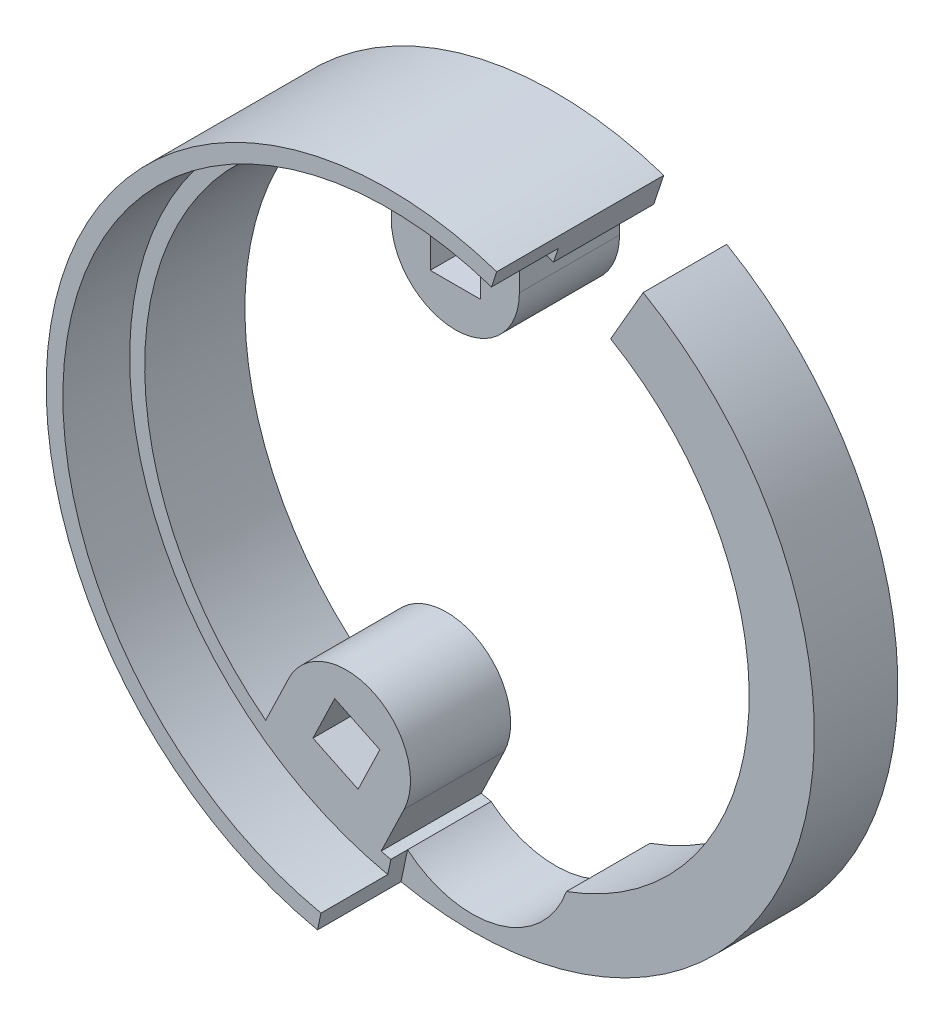
ISO-10303-21;
HEADER;
FILE_DESCRIPTION(('STEP AP214'),'2;1');
FILE_NAME('part.step','',(''),(''),'','','');
FILE_SCHEMA(('AUTOMOTIVE_DESIGN { 1 0 10303 214 1 1 1 1 }'));
ENDSEC;
DATA;
#1=APPLICATION_CONTEXT('core data for automotive mechanical design processes');
#2=APPLICATION_PROTOCOL_DEFINITION('international standard','automotive_design',2000,#1);
#3=PRODUCT_CONTEXT('',#1,'mechanical');
#4=PRODUCT('Part','Part','',(#3));
#5=PRODUCT_RELATED_PRODUCT_CATEGORY('part','',(#4));
#6=PRODUCT_DEFINITION_FORMATION('','',#4);
#7=PRODUCT_DEFINITION_CONTEXT('part definition',#1,'design');
#8=PRODUCT_DEFINITION('design','',#6,#7);
#9=PRODUCT_DEFINITION_SHAPE('','',#8);
#10=(LENGTH_UNIT() NAMED_UNIT(*) SI_UNIT(.MILLI.,.METRE.));
#11=(NAMED_UNIT(*) PLANE_ANGLE_UNIT() SI_UNIT($,.RADIAN.));
#12=(NAMED_UNIT(*) SI_UNIT($,.STERADIAN.) SOLID_ANGLE_UNIT());
#13=UNCERTAINTY_MEASURE_WITH_UNIT(LENGTH_MEASURE(1.E-05),#10,'distance_accuracy_value','');
#14=(GEOMETRIC_REPRESENTATION_CONTEXT(3) GLOBAL_UNCERTAINTY_ASSIGNED_CONTEXT((#13)) GLOBAL_UNIT_ASSIGNED_CONTEXT((#10,
#11,#12)) REPRESENTATION_CONTEXT('',''));
#15=CARTESIAN_POINT('',(0.,0.,0.));
#16=DIRECTION('',(0.,0.,1.));
#17=DIRECTION('',(1.,0.,0.));
#18=AXIS2_PLACEMENT_3D('',#15,#16,#17);
#19=CARTESIAN_POINT('',(0.,0.,6.));
#20=DIRECTION('',(0.,0.,-1.));
#21=DIRECTION('',(-1.,0.,0.));
#22=AXIS2_PLACEMENT_3D('',#19,#20,#21);
#23=CYLINDRICAL_SURFACE('',#22,18.6);
#24=DIRECTION('',(0.,0.,-1.));
#25=VECTOR('',#24,1.);
#26=CARTESIAN_POINT('',(-4.44120798788724,-18.0619952277794,18.0394074165412));
#27=LINE('',#26,#25);
#28=CARTESIAN_POINT('',(-4.44120798788724,-18.0619952277794,6.));
#29=VERTEX_POINT('',#28);
#30=CARTESIAN_POINT('',(-4.44120798788724,-18.0619952277794,0.));
#31=VERTEX_POINT('',#30);
#32=EDGE_CURVE('E296',#29,#31,#27,.T.);
#33=ORIENTED_EDGE('',*,*,#32,.F.);
#34=CARTESIAN_POINT('',(0.,0.,6.));
#35=DIRECTION('',(0.,0.,1.));
#36=DIRECTION('',(1.,0.,0.));
#37=AXIS2_PLACEMENT_3D('',#34,#35,#36);
#38=CIRCLE('',#37,18.6);
#39=CARTESIAN_POINT('',(-3.85753402728042,-18.1955882352941,6.));
#40=VERTEX_POINT('',#39);
#41=EDGE_CURVE('E393',#29,#40,#38,.T.);
#42=ORIENTED_EDGE('',*,*,#41,.T.);
#43=DIRECTION('',(0.,0.,-1.));
#44=VECTOR('',#43,1.);
#45=CARTESIAN_POINT('',(-3.85753402728042,-18.1955882352941,6.));
#46=LINE('',#45,#44);
#47=CARTESIAN_POINT('',(-3.85753402728042,-18.1955882352941,5.));
#48=VERTEX_POINT('',#47);
#49=EDGE_CURVE('E386',#40,#48,#46,.T.);
#50=ORIENTED_EDGE('',*,*,#49,.T.);
#51=CARTESIAN_POINT('',(-3.85753402728042,-18.1955882352941,0.));
#52=VERTEX_POINT('',#51);
#53=EDGE_CURVE('E389',#48,#52,#46,.T.);
#54=ORIENTED_EDGE('',*,*,#53,.T.);
#55=CARTESIAN_POINT('',(0.,0.,0.));
#56=DIRECTION('',(0.,0.,1.));
#57=DIRECTION('',(1.,0.,0.));
#58=AXIS2_PLACEMENT_3D('',#55,#56,#57);
#59=CIRCLE('',#58,18.6);
#60=EDGE_CURVE('E219',#31,#52,#59,.T.);
#61=ORIENTED_EDGE('',*,*,#60,.F.);
#62=EDGE_LOOP('',(#33,#42,#50,#54,#61));
#63=FACE_BOUND('',#62,.T.);
#64=ADVANCED_FACE('F35',(#63),#23,.F.);
#65=DIRECTION('',(0.,0.,-1.));
#66=VECTOR('',#65,1.);
#67=CARTESIAN_POINT('',(-11.3523886168903,-14.7337460508555,18.0394074165412));
#68=LINE('',#67,#66);
#69=CARTESIAN_POINT('',(-11.3523886168903,-14.7337460508555,6.));
#70=VERTEX_POINT('',#69);
#71=CARTESIAN_POINT('',(-11.3523886168903,-14.7337460508555,0.));
#72=VERTEX_POINT('',#71);
#73=EDGE_CURVE('E292',#70,#72,#68,.T.);
#74=ORIENTED_EDGE('',*,*,#73,.T.);
#75=CARTESIAN_POINT('',(-3.83541589238637,18.2002633204146,0.));
#76=VERTEX_POINT('',#75);
#77=EDGE_CURVE('E407',#76,#72,#59,.T.);
#78=ORIENTED_EDGE('',*,*,#77,.F.);
#79=DIRECTION('',(0.,0.,-1.));
#80=VECTOR('',#79,1.);
#81=CARTESIAN_POINT('',(-3.83541589238637,18.2002633204146,18.0394074165412));
#82=LINE('',#81,#80);
#83=CARTESIAN_POINT('',(-3.83541589238637,18.2002633204146,6.));
#84=VERTEX_POINT('',#83);
#85=EDGE_CURVE('E351',#84,#76,#82,.T.);
#86=ORIENTED_EDGE('',*,*,#85,.F.);
#87=EDGE_CURVE('E411',#84,#70,#38,.T.);
#88=ORIENTED_EDGE('',*,*,#87,.T.);
#89=EDGE_LOOP('',(#74,#78,#86,#88));
#90=FACE_BOUND('',#89,.T.);
#91=ADVANCED_FACE('F459',(#90),#23,.F.);
#92=CARTESIAN_POINT('',(0.,0.,6.));
#93=DIRECTION('',(-0.86602540378444,0.499999999999997,0.));
#94=DIRECTION('',(-0.499999999999997,-0.86602540378444,0.));
#95=AXIS2_PLACEMENT_3D('',#92,#93,#94);
#96=PLANE('',#95);
#97=DIRECTION('',(0.,0.,-1.));
#98=VECTOR('',#97,1.);
#99=CARTESIAN_POINT('',(8.29999999999997,14.3760217028217,6.));
#100=LINE('',#99,#98);
#101=CARTESIAN_POINT('',(8.29999999999997,14.3760217028217,5.));
#102=VERTEX_POINT('',#101);
#103=CARTESIAN_POINT('',(8.29999999999997,14.3760217028217,0.));
#104=VERTEX_POINT('',#103);
#105=EDGE_CURVE('E382',#102,#104,#100,.T.);
#106=ORIENTED_EDGE('',*,*,#105,.F.);
#107=DIRECTION('',(-0.499999999999996,-0.866025403784441,0.));
#108=VECTOR('',#107,1.);
#109=CARTESIAN_POINT('',(10.25,17.753520777581,5.));
#110=LINE('',#109,#108);
#111=CARTESIAN_POINT('',(10.25,17.753520777581,5.));
#112=VERTEX_POINT('',#111);
#113=EDGE_CURVE('E369',#112,#102,#110,.T.);
#114=ORIENTED_EDGE('',*,*,#113,.F.);
#115=DIRECTION('',(0.,0.,-1.));
#116=VECTOR('',#115,1.);
#117=CARTESIAN_POINT('',(10.25,17.753520777581,6.));
#118=LINE('',#117,#116);
#119=CARTESIAN_POINT('',(10.25,17.753520777581,0.));
#120=VERTEX_POINT('',#119);
#121=EDGE_CURVE('E380',#112,#120,#118,.T.);
#122=ORIENTED_EDGE('',*,*,#121,.T.);
#123=DIRECTION('',(0.499999999999997,0.86602540378444,0.));
#124=VECTOR('',#123,1.);
#125=CARTESIAN_POINT('',(0.,0.,0.));
#126=LINE('',#125,#124);
#127=EDGE_CURVE('E397',#104,#120,#126,.T.);
#128=ORIENTED_EDGE('',*,*,#127,.F.);
#129=EDGE_LOOP('',(#106,#114,#122,#128));
#130=FACE_BOUND('',#129,.T.);
#131=ADVANCED_FACE('F463',(#130),#96,.T.);
#132=CARTESIAN_POINT('',(0.,0.,6.));
#133=DIRECTION('',(0.,0.,-1.));
#134=DIRECTION('',(-1.,0.,0.));
#135=AXIS2_PLACEMENT_3D('',#132,#133,#134);
#136=CYLINDRICAL_SURFACE('',#135,16.6);
#137=DIRECTION('',(0.,0.,-1.));
#138=VECTOR('',#137,1.);
#139=CARTESIAN_POINT('',(5.65424921360477,-15.6073529411765,6.));
#140=LINE('',#139,#138);
#141=CARTESIAN_POINT('',(5.65424921360477,-15.6073529411765,5.));
#142=VERTEX_POINT('',#141);
#143=CARTESIAN_POINT('',(5.65424921360477,-15.6073529411765,0.));
#144=VERTEX_POINT('',#143);
#145=EDGE_CURVE('E384',#142,#144,#140,.T.);
#146=ORIENTED_EDGE('',*,*,#145,.F.);
#147=CARTESIAN_POINT('',(0.,0.,5.));
#148=DIRECTION('',(0.,0.,-1.));
#149=DIRECTION('',(1.,0.,0.));
#150=AXIS2_PLACEMENT_3D('',#147,#148,#149);
#151=CIRCLE('',#150,16.6);
#152=EDGE_CURVE('E371',#102,#142,#151,.T.);
#153=ORIENTED_EDGE('',*,*,#152,.F.);
#154=ORIENTED_EDGE('',*,*,#105,.T.);
#155=CARTESIAN_POINT('',(0.,0.,0.));
#156=DIRECTION('',(0.,0.,1.));
#157=DIRECTION('',(1.,0.,0.));
#158=AXIS2_PLACEMENT_3D('',#155,#156,#157);
#159=CIRCLE('',#158,16.6);
#160=EDGE_CURVE('E394',#144,#104,#159,.T.);
#161=ORIENTED_EDGE('',*,*,#160,.F.);
#162=EDGE_LOOP('',(#146,#153,#154,#161));
#163=FACE_BOUND('',#162,.T.);
#164=ADVANCED_FACE('F473',(#163),#136,.F.);
#165=CARTESIAN_POINT('',(0.,-13.6,6.));
#166=DIRECTION('',(0.,0.,-1.));
#167=DIRECTION('',(-1.,0.,0.));
#168=AXIS2_PLACEMENT_3D('',#165,#166,#167);
#169=CYLINDRICAL_SURFACE('',#168,6.);
#170=ORIENTED_EDGE('',*,*,#53,.F.);
#171=CARTESIAN_POINT('',(0.,-13.6,5.));
#172=DIRECTION('',(0.,0.,-1.));
#173=DIRECTION('',(1.,0.,0.));
#174=AXIS2_PLACEMENT_3D('',#171,#172,#173);
#175=CIRCLE('',#174,6.);
#176=EDGE_CURVE('E373',#142,#48,#175,.T.);
#177=ORIENTED_EDGE('',*,*,#176,.F.);
#178=ORIENTED_EDGE('',*,*,#145,.T.);
#179=CARTESIAN_POINT('',(0.,-13.6,0.));
#180=DIRECTION('',(0.,0.,1.));
#181=DIRECTION('',(1.,0.,0.));
#182=AXIS2_PLACEMENT_3D('',#179,#180,#181);
#183=CIRCLE('',#182,6.);
#184=EDGE_CURVE('E390',#52,#144,#183,.T.);
#185=ORIENTED_EDGE('',*,*,#184,.F.);
#186=EDGE_LOOP('',(#170,#177,#178,#185));
#187=FACE_BOUND('',#186,.T.);
#188=ADVANCED_FACE('F467',(#187),#169,.F.);
#189=DIRECTION('',(0.,0.,-1.));
#190=VECTOR('',#189,1.);
#191=CARTESIAN_POINT('',(3.83541589239431,18.200263320413,18.0394074165412));
#192=LINE('',#191,#190);
#193=CARTESIAN_POINT('',(3.83541589239431,18.200263320413,6.));
#194=VERTEX_POINT('',#193);
#195=CARTESIAN_POINT('',(3.83541589239431,18.200263320413,0.));
#196=VERTEX_POINT('',#195);
#197=EDGE_CURVE('E347',#194,#196,#192,.T.);
#198=ORIENTED_EDGE('',*,*,#197,.T.);
#199=CARTESIAN_POINT('',(5.88204496096024,17.6454398380217,0.));
#200=VERTEX_POINT('',#199);
#201=EDGE_CURVE('E405',#200,#196,#59,.T.);
#202=ORIENTED_EDGE('',*,*,#201,.F.);
#203=DIRECTION('',(0.,0.,-1.));
#204=VECTOR('',#203,1.);
#205=CARTESIAN_POINT('',(5.88204496096024,17.6454398380217,6.));
#206=LINE('',#205,#204);
#207=CARTESIAN_POINT('',(5.88204496096024,17.6454398380217,6.));
#208=VERTEX_POINT('',#207);
#209=EDGE_CURVE('E11',#208,#200,#206,.T.);
#210=ORIENTED_EDGE('',*,*,#209,.F.);
#211=EDGE_CURVE('E409',#208,#194,#38,.T.);
#212=ORIENTED_EDGE('',*,*,#211,.T.);
#213=EDGE_LOOP('',(#198,#202,#210,#212));
#214=FACE_BOUND('',#213,.T.);
#215=ADVANCED_FACE('F37',(#214),#23,.F.);
#216=CARTESIAN_POINT('',(0.,0.,6.));
#217=DIRECTION('',(-0.948679561183961,0.316238976395712,0.));
#218=DIRECTION('',(-0.316238976395712,-0.948679561183961,0.));
#219=AXIS2_PLACEMENT_3D('',#216,#217,#218);
#220=PLANE('',#219);
#221=DIRECTION('',(0.316238976395712,0.948679561183961,0.));
#222=VECTOR('',#221,1.);
#223=CARTESIAN_POINT('',(0.,0.,0.));
#224=LINE('',#223,#222);
#225=CARTESIAN_POINT('',(6.48289901611209,19.4479310042712,0.));
#226=VERTEX_POINT('',#225);
#227=EDGE_CURVE('E403',#200,#226,#224,.T.);
#228=ORIENTED_EDGE('',*,*,#227,.T.);
#229=DIRECTION('',(0.,0.,-1.));
#230=VECTOR('',#229,1.);
#231=CARTESIAN_POINT('',(6.48289901611209,19.4479310042712,6.));
#232=LINE('',#231,#230);
#233=CARTESIAN_POINT('',(6.48289901611209,19.4479310042712,10.));
#234=VERTEX_POINT('',#233);
#235=EDGE_CURVE('E44',#234,#226,#232,.T.);
#236=ORIENTED_EDGE('',*,*,#235,.F.);
#237=DIRECTION('',(0.316238976395713,0.94867956118396,0.));
#238=VECTOR('',#237,1.);
#239=CARTESIAN_POINT('',(6.16666003971638,18.4992514430872,10.));
#240=LINE('',#239,#238);
#241=CARTESIAN_POINT('',(6.16666003971638,18.4992514430872,10.));
#242=VERTEX_POINT('',#241);
#243=EDGE_CURVE('E234',#242,#234,#240,.T.);
#244=ORIENTED_EDGE('',*,*,#243,.F.);
#245=DIRECTION('',(0.,0.,-1.));
#246=VECTOR('',#245,1.);
#247=CARTESIAN_POINT('',(6.16666003971638,18.4992514430872,10.));
#248=LINE('',#247,#246);
#249=CARTESIAN_POINT('',(6.16666003971638,18.4992514430872,6.));
#250=VERTEX_POINT('',#249);
#251=EDGE_CURVE('E240',#242,#250,#248,.T.);
#252=ORIENTED_EDGE('',*,*,#251,.T.);
#253=DIRECTION('',(0.316238976395712,0.948679561183961,0.));
#254=VECTOR('',#253,1.);
#255=CARTESIAN_POINT('',(0.,0.,6.));
#256=LINE('',#255,#254);
#257=EDGE_CURVE('E247',#208,#250,#256,.T.);
#258=ORIENTED_EDGE('',*,*,#257,.F.);
#259=ORIENTED_EDGE('',*,*,#209,.T.);
#260=EDGE_LOOP('',(#228,#236,#244,#252,#258,#259));
#261=FACE_BOUND('',#260,.T.);
#262=ADVANCED_FACE('F466',(#261),#220,.F.);
#263=CARTESIAN_POINT('',(0.,0.,6.));
#264=DIRECTION('',(0.,0.,-1.));
#265=DIRECTION('',(-1.,0.,0.));
#266=AXIS2_PLACEMENT_3D('',#263,#264,#265);
#267=CYLINDRICAL_SURFACE('',#266,20.5);
#268=CARTESIAN_POINT('',(0.,0.,5.));
#269=DIRECTION('',(0.,0.,1.));
#270=DIRECTION('',(1.,0.,0.));
#271=AXIS2_PLACEMENT_3D('',#268,#269,#270);
#272=CIRCLE('',#271,20.5);
#273=CARTESIAN_POINT('',(-4.25158320211014,-20.0542773561037,5.));
#274=VERTEX_POINT('',#273);
#275=EDGE_CURVE('E215',#274,#112,#272,.T.);
#276=ORIENTED_EDGE('',*,*,#275,.F.);
#277=DIRECTION('',(0.,0.,1.));
#278=VECTOR('',#277,1.);
#279=CARTESIAN_POINT('',(-4.25158320211014,-20.0542773561037,5.));
#280=LINE('',#279,#278);
#281=CARTESIAN_POINT('',(-4.25158320211014,-20.0542773561037,10.));
#282=VERTEX_POINT('',#281);
#283=EDGE_CURVE('E208',#274,#282,#280,.T.);
#284=ORIENTED_EDGE('',*,*,#283,.T.);
#285=CARTESIAN_POINT('',(0.,0.,10.));
#286=DIRECTION('',(0.,0.,1.));
#287=DIRECTION('',(1.,0.,0.));
#288=AXIS2_PLACEMENT_3D('',#285,#286,#287);
#289=CIRCLE('',#288,20.5);
#290=EDGE_CURVE('E213',#234,#282,#289,.T.);
#291=ORIENTED_EDGE('',*,*,#290,.F.);
#292=ORIENTED_EDGE('',*,*,#235,.T.);
#293=CARTESIAN_POINT('',(0.,0.,0.));
#294=DIRECTION('',(0.,0.,1.));
#295=DIRECTION('',(1.,0.,0.));
#296=AXIS2_PLACEMENT_3D('',#293,#294,#295);
#297=CIRCLE('',#296,20.5);
#298=EDGE_CURVE('E400',#226,#120,#297,.T.);
#299=ORIENTED_EDGE('',*,*,#298,.T.);
#300=ORIENTED_EDGE('',*,*,#121,.F.);
#301=EDGE_LOOP('',(#276,#284,#291,#292,#299,#300));
#302=FACE_BOUND('',#301,.T.);
#303=ADVANCED_FACE('F210',(#302),#267,.T.);
#304=CARTESIAN_POINT('',(0.,0.,6.));
#305=DIRECTION('',(0.,0.,1.));
#306=DIRECTION('',(1.,0.,0.));
#307=AXIS2_PLACEMENT_3D('',#304,#305,#306);
#308=PLANE('',#307);
#309=CARTESIAN_POINT('',(0.,0.,6.));
#310=DIRECTION('',(0.,0.,-1.));
#311=DIRECTION('',(1.,0.,0.));
#312=AXIS2_PLACEMENT_3D('',#309,#310,#311);
#313=CIRCLE('',#312,19.5);
#314=CARTESIAN_POINT('',(-4.04418889956818,-19.0760199240987,6.));
#315=VERTEX_POINT('',#314);
#316=EDGE_CURVE('E52',#315,#250,#313,.T.);
#317=ORIENTED_EDGE('',*,*,#316,.F.);
#318=DIRECTION('',(-0.207394302541957,-0.97825743200506,0.));
#319=VECTOR('',#318,1.);
#320=CARTESIAN_POINT('',(-3.85753402728042,-18.1955882352941,6.));
#321=LINE('',#320,#319);
#322=EDGE_CURVE('E367',#40,#315,#321,.T.);
#323=ORIENTED_EDGE('',*,*,#322,.F.);
#324=ORIENTED_EDGE('',*,*,#41,.F.);
#325=DIRECTION('',(-0.433883739117553,-0.900968867902422,0.));
#326=VECTOR('',#325,1.);
#327=CARTESIAN_POINT('',(3.4555903144983,-1.66412458845948,6.));
#328=LINE('',#327,#326);
#329=CARTESIAN_POINT('',(-3.06532979610734,-15.2049547234712,6.));
#330=VERTEX_POINT('',#329);
#331=EDGE_CURVE('E243',#330,#29,#328,.T.);
#332=ORIENTED_EDGE('',*,*,#331,.F.);
#333=CARTESIAN_POINT('',(-6.52092011060922,-13.54083013501,6.));
#334=DIRECTION('',(0.,0.,1.));
#335=DIRECTION('',(1.,0.,0.));
#336=AXIS2_PLACEMENT_3D('',#333,#334,#335);
#337=CIRCLE('',#336,3.83541589239033);
#338=CARTESIAN_POINT('',(-9.97651042511108,-11.8767055465487,6.));
#339=VERTEX_POINT('',#338);
#340=EDGE_CURVE('E295',#339,#330,#337,.F.);
#341=ORIENTED_EDGE('',*,*,#340,.F.);
#342=DIRECTION('',(0.433883739117553,0.900968867902422,0.));
#343=VECTOR('',#342,1.);
#344=CARTESIAN_POINT('',(-3.45559031450545,1.66412458846292,6.));
#345=LINE('',#344,#343);
#346=EDGE_CURVE('E254',#70,#339,#345,.T.);
#347=ORIENTED_EDGE('',*,*,#346,.F.);
#348=ORIENTED_EDGE('',*,*,#87,.F.);
#349=DIRECTION('',(0.,1.,0.));
#350=VECTOR('',#349,1.);
#351=CARTESIAN_POINT('',(-3.83541589238637,0.,6.));
#352=LINE('',#351,#350);
#353=CARTESIAN_POINT('',(-3.83541589238637,15.0291875972769,6.));
#354=VERTEX_POINT('',#353);
#355=EDGE_CURVE('E311',#354,#84,#352,.T.);
#356=ORIENTED_EDGE('',*,*,#355,.F.);
#357=CARTESIAN_POINT('',(3.97034835564192E-12,15.0291875972769,6.));
#358=DIRECTION('',(0.,0.,1.));
#359=DIRECTION('',(1.,0.,0.));
#360=AXIS2_PLACEMENT_3D('',#357,#358,#359);
#361=CIRCLE('',#360,3.83541589239034);
#362=CARTESIAN_POINT('',(3.83541589239431,15.0291875972769,6.));
#363=VERTEX_POINT('',#362);
#364=EDGE_CURVE('E350',#363,#354,#361,.F.);
#365=ORIENTED_EDGE('',*,*,#364,.F.);
#366=DIRECTION('',(0.,-1.,0.));
#367=VECTOR('',#366,1.);
#368=CARTESIAN_POINT('',(3.83541589239431,0.,6.));
#369=LINE('',#368,#367);
#370=EDGE_CURVE('E313',#194,#363,#369,.T.);
#371=ORIENTED_EDGE('',*,*,#370,.F.);
#372=ORIENTED_EDGE('',*,*,#211,.F.);
#373=ORIENTED_EDGE('',*,*,#257,.T.);
#374=EDGE_LOOP('',(#317,#323,#324,#332,#341,#347,#348,#356,#365,#371,#372,#373));
#375=FACE_BOUND('',#374,.T.);
#376=DIRECTION('',(1.,0.,0.));
#377=VECTOR('',#376,1.);
#378=CARTESIAN_POINT('',(0.,13.5291875972755,6.));
#379=LINE('',#378,#377);
#380=CARTESIAN_POINT('',(-1.49999999999748,13.5291875972755,6.));
#381=VERTEX_POINT('',#380);
#382=CARTESIAN_POINT('',(1.50000000000539,13.5291875972755,6.));
#383=VERTEX_POINT('',#382);
#384=EDGE_CURVE('E323',#381,#383,#379,.T.);
#385=ORIENTED_EDGE('',*,*,#384,.F.);
#386=DIRECTION('',(0.,1.,0.));
#387=VECTOR('',#386,1.);
#388=CARTESIAN_POINT('',(-1.49999999999748,0.,6.));
#389=LINE('',#388,#387);
#390=CARTESIAN_POINT('',(-1.49999999999748,16.5291875972783,6.));
#391=VERTEX_POINT('',#390);
#392=EDGE_CURVE('E321',#381,#391,#389,.T.);
#393=ORIENTED_EDGE('',*,*,#392,.T.);
#394=DIRECTION('',(1.,0.,0.));
#395=VECTOR('',#394,1.);
#396=CARTESIAN_POINT('',(0.,16.5291875972783,6.));
#397=LINE('',#396,#395);
#398=CARTESIAN_POINT('',(1.50000000000539,16.5291875972783,6.));
#399=VERTEX_POINT('',#398);
#400=EDGE_CURVE('E319',#391,#399,#397,.T.);
#401=ORIENTED_EDGE('',*,*,#400,.T.);
#402=DIRECTION('',(0.,1.,0.));
#403=VECTOR('',#402,1.);
#404=CARTESIAN_POINT('',(1.50000000000539,0.,6.));
#405=LINE('',#404,#403);
#406=EDGE_CURVE('E316',#383,#399,#405,.T.);
#407=ORIENTED_EDGE('',*,*,#406,.F.);
#408=EDGE_LOOP('',(#385,#393,#401,#407));
#409=FACE_BOUND('',#408,.T.);
#410=DIRECTION('',(-0.900968867902422,0.433883739117552,0.));
#411=VECTOR('',#410,1.);
#412=CARTESIAN_POINT('',(-5.87009450192869,-12.1893768331568,6.));
#413=LINE('',#412,#411);
#414=CARTESIAN_POINT('',(-4.51864120007733,-12.840202441832,6.));
#415=VERTEX_POINT('',#414);
#416=CARTESIAN_POINT('',(-7.22154780378718,-11.5385512244781,6.));
#417=VERTEX_POINT('',#416);
#418=EDGE_CURVE('E270',#415,#417,#413,.T.);
#419=ORIENTED_EDGE('',*,*,#418,.F.);
#420=DIRECTION('',(-0.433883739117553,-0.900968867902422,0.));
#421=VECTOR('',#420,1.);
#422=CARTESIAN_POINT('',(1.35145330185137,-0.650825608675239,6.));
#423=LINE('',#422,#421);
#424=CARTESIAN_POINT('',(-5.82029241743123,-15.5431090455418,6.));
#425=VERTEX_POINT('',#424);
#426=EDGE_CURVE('E268',#415,#425,#423,.T.);
#427=ORIENTED_EDGE('',*,*,#426,.T.);
#428=DIRECTION('',(-0.900968867902422,0.433883739117553,0.));
#429=VECTOR('',#428,1.);
#430=CARTESIAN_POINT('',(-7.17174571928259,-14.8922834368666,6.));
#431=LINE('',#430,#429);
#432=CARTESIAN_POINT('',(-8.52319902114108,-14.2414578281879,6.));
#433=VERTEX_POINT('',#432);
#434=EDGE_CURVE('E264',#425,#433,#431,.T.);
#435=ORIENTED_EDGE('',*,*,#434,.T.);
#436=DIRECTION('',(-0.433883739117553,-0.900968867902422,0.));
#437=VECTOR('',#436,1.);
#438=CARTESIAN_POINT('',(-1.35145330185848,0.650825608678665,6.));
#439=LINE('',#438,#437);
#440=EDGE_CURVE('E259',#417,#433,#439,.T.);
#441=ORIENTED_EDGE('',*,*,#440,.F.);
#442=EDGE_LOOP('',(#419,#427,#435,#441));
#443=FACE_BOUND('',#442,.T.);
#444=ADVANCED_FACE('F421',(#375,#409,#443),#308,.T.);
#445=CARTESIAN_POINT('',(0.,0.,0.));
#446=DIRECTION('',(0.,0.,1.));
#447=DIRECTION('',(1.,0.,0.));
#448=AXIS2_PLACEMENT_3D('',#445,#446,#447);
#449=PLANE('',#448);
#450=ORIENTED_EDGE('',*,*,#201,.T.);
#451=DIRECTION('',(0.,-1.,0.));
#452=VECTOR('',#451,1.);
#453=CARTESIAN_POINT('',(3.83541589239431,0.,0.));
#454=LINE('',#453,#452);
#455=CARTESIAN_POINT('',(3.83541589239431,15.0291875972769,0.));
#456=VERTEX_POINT('',#455);
#457=EDGE_CURVE('E338',#196,#456,#454,.T.);
#458=ORIENTED_EDGE('',*,*,#457,.T.);
#459=CARTESIAN_POINT('',(3.97034835564192E-12,15.0291875972769,0.));
#460=DIRECTION('',(0.,0.,-1.));
#461=DIRECTION('',(-1.,0.,0.));
#462=AXIS2_PLACEMENT_3D('',#459,#460,#461);
#463=CIRCLE('',#462,3.83541589239034);
#464=CARTESIAN_POINT('',(-3.83541589238637,15.0291875972769,0.));
#465=VERTEX_POINT('',#464);
#466=EDGE_CURVE('E341',#456,#465,#463,.T.);
#467=ORIENTED_EDGE('',*,*,#466,.T.);
#468=DIRECTION('',(0.,1.,0.));
#469=VECTOR('',#468,1.);
#470=CARTESIAN_POINT('',(-3.83541589238637,0.,0.));
#471=LINE('',#470,#469);
#472=EDGE_CURVE('E344',#465,#76,#471,.T.);
#473=ORIENTED_EDGE('',*,*,#472,.T.);
#474=ORIENTED_EDGE('',*,*,#77,.T.);
#475=DIRECTION('',(0.433883739117553,0.900968867902422,0.));
#476=VECTOR('',#475,1.);
#477=CARTESIAN_POINT('',(-3.45559031450545,1.66412458846292,0.));
#478=LINE('',#477,#476);
#479=CARTESIAN_POINT('',(-9.97651042511108,-11.8767055465487,0.));
#480=VERTEX_POINT('',#479);
#481=EDGE_CURVE('E285',#72,#480,#478,.T.);
#482=ORIENTED_EDGE('',*,*,#481,.T.);
#483=CARTESIAN_POINT('',(-6.52092011060922,-13.54083013501,0.));
#484=DIRECTION('',(0.,0.,-1.));
#485=DIRECTION('',(-1.,0.,0.));
#486=AXIS2_PLACEMENT_3D('',#483,#484,#485);
#487=CIRCLE('',#486,3.83541589239033);
#488=CARTESIAN_POINT('',(-3.06532979610734,-15.2049547234712,0.));
#489=VERTEX_POINT('',#488);
#490=EDGE_CURVE('E288',#480,#489,#487,.T.);
#491=ORIENTED_EDGE('',*,*,#490,.T.);
#492=DIRECTION('',(-0.433883739117553,-0.900968867902422,0.));
#493=VECTOR('',#492,1.);
#494=CARTESIAN_POINT('',(3.4555903144983,-1.66412458845948,0.));
#495=LINE('',#494,#493);
#496=EDGE_CURVE('E60',#489,#31,#495,.T.);
#497=ORIENTED_EDGE('',*,*,#496,.T.);
#498=ORIENTED_EDGE('',*,*,#60,.T.);
#499=ORIENTED_EDGE('',*,*,#184,.T.);
#500=ORIENTED_EDGE('',*,*,#160,.T.);
#501=ORIENTED_EDGE('',*,*,#127,.T.);
#502=ORIENTED_EDGE('',*,*,#298,.F.);
#503=ORIENTED_EDGE('',*,*,#227,.F.);
#504=EDGE_LOOP('',(#450,#458,#467,#473,#474,#482,#491,#497,#498,#499,#500,#501,#502,#503));
#505=FACE_BOUND('',#504,.T.);
#506=DIRECTION('',(1.,0.,0.));
#507=VECTOR('',#506,1.);
#508=CARTESIAN_POINT('',(0.,13.5291875972755,0.));
#509=LINE('',#508,#507);
#510=CARTESIAN_POINT('',(-1.49999999999748,13.5291875972755,0.));
#511=VERTEX_POINT('',#510);
#512=CARTESIAN_POINT('',(1.50000000000539,13.5291875972755,0.));
#513=VERTEX_POINT('',#512);
#514=EDGE_CURVE('E326',#511,#513,#509,.T.);
#515=ORIENTED_EDGE('',*,*,#514,.T.);
#516=DIRECTION('',(0.,1.,0.));
#517=VECTOR('',#516,1.);
#518=CARTESIAN_POINT('',(1.50000000000539,0.,0.));
#519=LINE('',#518,#517);
#520=CARTESIAN_POINT('',(1.50000000000539,16.5291875972783,0.));
#521=VERTEX_POINT('',#520);
#522=EDGE_CURVE('E329',#513,#521,#519,.T.);
#523=ORIENTED_EDGE('',*,*,#522,.T.);
#524=DIRECTION('',(1.,0.,0.));
#525=VECTOR('',#524,1.);
#526=CARTESIAN_POINT('',(0.,16.5291875972783,0.));
#527=LINE('',#526,#525);
#528=CARTESIAN_POINT('',(-1.49999999999748,16.5291875972783,0.));
#529=VERTEX_POINT('',#528);
#530=EDGE_CURVE('E332',#529,#521,#527,.T.);
#531=ORIENTED_EDGE('',*,*,#530,.F.);
#532=DIRECTION('',(0.,1.,0.));
#533=VECTOR('',#532,1.);
#534=CARTESIAN_POINT('',(-1.49999999999748,0.,0.));
#535=LINE('',#534,#533);
#536=EDGE_CURVE('E335',#511,#529,#535,.T.);
#537=ORIENTED_EDGE('',*,*,#536,.F.);
#538=EDGE_LOOP('',(#515,#523,#531,#537));
#539=FACE_BOUND('',#538,.T.);
#540=DIRECTION('',(-0.900968867902422,0.433883739117552,0.));
#541=VECTOR('',#540,1.);
#542=CARTESIAN_POINT('',(-5.87009450192869,-12.1893768331568,0.));
#543=LINE('',#542,#541);
#544=CARTESIAN_POINT('',(-4.51864120007733,-12.840202441832,0.));
#545=VERTEX_POINT('',#544);
#546=CARTESIAN_POINT('',(-7.22154780378718,-11.5385512244781,0.));
#547=VERTEX_POINT('',#546);
#548=EDGE_CURVE('E273',#545,#547,#543,.T.);
#549=ORIENTED_EDGE('',*,*,#548,.T.);
#550=DIRECTION('',(-0.433883739117553,-0.900968867902422,0.));
#551=VECTOR('',#550,1.);
#552=CARTESIAN_POINT('',(-1.35145330185848,0.650825608678665,0.));
#553=LINE('',#552,#551);
#554=CARTESIAN_POINT('',(-8.52319902114108,-14.2414578281879,0.));
#555=VERTEX_POINT('',#554);
#556=EDGE_CURVE('E276',#547,#555,#553,.T.);
#557=ORIENTED_EDGE('',*,*,#556,.T.);
#558=DIRECTION('',(-0.900968867902422,0.433883739117553,0.));
#559=VECTOR('',#558,1.);
#560=CARTESIAN_POINT('',(-7.17174571928259,-14.8922834368666,0.));
#561=LINE('',#560,#559);
#562=CARTESIAN_POINT('',(-5.82029241743123,-15.5431090455418,0.));
#563=VERTEX_POINT('',#562);
#564=EDGE_CURVE('E279',#563,#555,#561,.T.);
#565=ORIENTED_EDGE('',*,*,#564,.F.);
#566=DIRECTION('',(-0.433883739117553,-0.900968867902422,0.));
#567=VECTOR('',#566,1.);
#568=CARTESIAN_POINT('',(1.35145330185137,-0.650825608675239,0.));
#569=LINE('',#568,#567);
#570=EDGE_CURVE('E282',#545,#563,#569,.T.);
#571=ORIENTED_EDGE('',*,*,#570,.F.);
#572=EDGE_LOOP('',(#549,#557,#565,#571));
#573=FACE_BOUND('',#572,.T.);
#574=ADVANCED_FACE('F424',(#505,#539,#573),#449,.F.);
#575=CARTESIAN_POINT('',(-3.85753402728042,-18.1955882352941,5.));
#576=DIRECTION('',(-0.97825743200506,0.207394302541957,0.));
#577=DIRECTION('',(-0.207394302541957,-0.97825743200506,0.));
#578=AXIS2_PLACEMENT_3D('',#575,#576,#577);
#579=PLANE('',#578);
#580=ORIENTED_EDGE('',*,*,#322,.T.);
#581=DIRECTION('',(0.,0.,-1.));
#582=VECTOR('',#581,1.);
#583=CARTESIAN_POINT('',(-4.04418889956818,-19.0760199240987,10.));
#584=LINE('',#583,#582);
#585=CARTESIAN_POINT('',(-4.04418889956818,-19.0760199240987,10.));
#586=VERTEX_POINT('',#585);
#587=EDGE_CURVE('E226',#586,#315,#584,.T.);
#588=ORIENTED_EDGE('',*,*,#587,.F.);
#589=DIRECTION('',(0.207394302541957,0.978257432005061,0.));
#590=VECTOR('',#589,1.);
#591=CARTESIAN_POINT('',(-4.04418889956818,-19.0760199240987,10.));
#592=LINE('',#591,#590);
#593=EDGE_CURVE('E223',#282,#586,#592,.T.);
#594=ORIENTED_EDGE('',*,*,#593,.F.);
#595=ORIENTED_EDGE('',*,*,#283,.F.);
#596=DIRECTION('',(-0.207394302541957,-0.97825743200506,0.));
#597=VECTOR('',#596,1.);
#598=CARTESIAN_POINT('',(-3.85753402728042,-18.1955882352941,5.));
#599=LINE('',#598,#597);
#600=EDGE_CURVE('E220',#48,#274,#599,.T.);
#601=ORIENTED_EDGE('',*,*,#600,.F.);
#602=ORIENTED_EDGE('',*,*,#49,.F.);
#603=EDGE_LOOP('',(#580,#588,#594,#595,#601,#602));
#604=FACE_BOUND('',#603,.T.);
#605=ADVANCED_FACE('F224',(#604),#579,.F.);
#606=CARTESIAN_POINT('',(0.,0.,5.));
#607=DIRECTION('',(0.,0.,1.));
#608=DIRECTION('',(1.,0.,0.));
#609=AXIS2_PLACEMENT_3D('',#606,#607,#608);
#610=PLANE('',#609);
#611=ORIENTED_EDGE('',*,*,#275,.T.);
#612=ORIENTED_EDGE('',*,*,#113,.T.);
#613=ORIENTED_EDGE('',*,*,#152,.T.);
#614=ORIENTED_EDGE('',*,*,#176,.T.);
#615=ORIENTED_EDGE('',*,*,#600,.T.);
#616=EDGE_LOOP('',(#611,#612,#613,#614,#615));
#617=FACE_BOUND('',#616,.T.);
#618=ADVANCED_FACE('F454',(#617),#610,.T.);
#619=CARTESIAN_POINT('',(1.50000000000539,0.,18.0394074165412));
#620=DIRECTION('',(-1.,0.,0.));
#621=DIRECTION('',(0.,-1.,0.));
#622=AXIS2_PLACEMENT_3D('',#619,#620,#621);
#623=PLANE('',#622);
#624=DIRECTION('',(0.,0.,-1.));
#625=VECTOR('',#624,1.);
#626=CARTESIAN_POINT('',(1.50000000000539,13.5291875972755,18.0394074165412));
#627=LINE('',#626,#625);
#628=EDGE_CURVE('E346',#383,#513,#627,.T.);
#629=ORIENTED_EDGE('',*,*,#628,.F.);
#630=ORIENTED_EDGE('',*,*,#406,.T.);
#631=DIRECTION('',(0.,0.,-1.));
#632=VECTOR('',#631,1.);
#633=CARTESIAN_POINT('',(1.50000000000539,16.5291875972783,18.0394074165412));
#634=LINE('',#633,#632);
#635=EDGE_CURVE('E362',#399,#521,#634,.T.);
#636=ORIENTED_EDGE('',*,*,#635,.T.);
#637=ORIENTED_EDGE('',*,*,#522,.F.);
#638=EDGE_LOOP('',(#629,#630,#636,#637));
#639=FACE_BOUND('',#638,.T.);
#640=ADVANCED_FACE('F541',(#639),#623,.T.);
#641=CARTESIAN_POINT('',(0.,16.5291875972783,18.0394074165412));
#642=DIRECTION('',(0.,1.,0.));
#643=DIRECTION('',(0.,0.,1.));
#644=AXIS2_PLACEMENT_3D('',#641,#642,#643);
#645=PLANE('',#644);
#646=ORIENTED_EDGE('',*,*,#400,.F.);
#647=DIRECTION('',(0.,0.,-1.));
#648=VECTOR('',#647,1.);
#649=CARTESIAN_POINT('',(-1.49999999999748,16.5291875972783,18.0394074165412));
#650=LINE('',#649,#648);
#651=EDGE_CURVE('E360',#391,#529,#650,.T.);
#652=ORIENTED_EDGE('',*,*,#651,.T.);
#653=ORIENTED_EDGE('',*,*,#530,.T.);
#654=ORIENTED_EDGE('',*,*,#635,.F.);
#655=EDGE_LOOP('',(#646,#652,#653,#654));
#656=FACE_BOUND('',#655,.T.);
#657=ADVANCED_FACE('F537',(#656),#645,.F.);
#658=CARTESIAN_POINT('',(-1.49999999999748,0.,18.0394074165412));
#659=DIRECTION('',(-1.,0.,0.));
#660=DIRECTION('',(0.,-1.,0.));
#661=AXIS2_PLACEMENT_3D('',#658,#659,#660);
#662=PLANE('',#661);
#663=ORIENTED_EDGE('',*,*,#392,.F.);
#664=DIRECTION('',(0.,0.,-1.));
#665=VECTOR('',#664,1.);
#666=CARTESIAN_POINT('',(-1.49999999999748,13.5291875972755,18.0394074165412));
#667=LINE('',#666,#665);
#668=EDGE_CURVE('E358',#381,#511,#667,.T.);
#669=ORIENTED_EDGE('',*,*,#668,.T.);
#670=ORIENTED_EDGE('',*,*,#536,.T.);
#671=ORIENTED_EDGE('',*,*,#651,.F.);
#672=EDGE_LOOP('',(#663,#669,#670,#671));
#673=FACE_BOUND('',#672,.T.);
#674=ADVANCED_FACE('F534',(#673),#662,.F.);
#675=CARTESIAN_POINT('',(0.,13.5291875972755,18.0394074165412));
#676=DIRECTION('',(0.,1.,0.));
#677=DIRECTION('',(0.,0.,1.));
#678=AXIS2_PLACEMENT_3D('',#675,#676,#677);
#679=PLANE('',#678);
#680=ORIENTED_EDGE('',*,*,#668,.F.);
#681=ORIENTED_EDGE('',*,*,#384,.T.);
#682=ORIENTED_EDGE('',*,*,#628,.T.);
#683=ORIENTED_EDGE('',*,*,#514,.F.);
#684=EDGE_LOOP('',(#680,#681,#682,#683));
#685=FACE_BOUND('',#684,.T.);
#686=ADVANCED_FACE('F530',(#685),#679,.T.);
#687=CARTESIAN_POINT('',(3.97034835564192E-12,15.0291875972769,18.0394074165412));
#688=DIRECTION('',(0.,0.,-1.));
#689=DIRECTION('',(-1.,0.,0.));
#690=AXIS2_PLACEMENT_3D('',#687,#688,#689);
#691=CYLINDRICAL_SURFACE('',#690,3.83541589239034);
#692=DIRECTION('',(0.,0.,-1.));
#693=VECTOR('',#692,1.);
#694=CARTESIAN_POINT('',(3.83541589239431,15.0291875972769,18.0394074165412));
#695=LINE('',#694,#693);
#696=EDGE_CURVE('E356',#363,#456,#695,.T.);
#697=ORIENTED_EDGE('',*,*,#696,.F.);
#698=ORIENTED_EDGE('',*,*,#364,.T.);
#699=DIRECTION('',(0.,0.,-1.));
#700=VECTOR('',#699,1.);
#701=CARTESIAN_POINT('',(-3.83541589238637,15.0291875972769,18.0394074165412));
#702=LINE('',#701,#700);
#703=EDGE_CURVE('E354',#354,#465,#702,.T.);
#704=ORIENTED_EDGE('',*,*,#703,.T.);
#705=ORIENTED_EDGE('',*,*,#466,.F.);
#706=EDGE_LOOP('',(#697,#698,#704,#705));
#707=FACE_BOUND('',#706,.T.);
#708=ADVANCED_FACE('F526',(#707),#691,.T.);
#709=CARTESIAN_POINT('',(-3.83541589238637,0.,18.0394074165412));
#710=DIRECTION('',(-1.,0.,0.));
#711=DIRECTION('',(0.,0.,1.));
#712=AXIS2_PLACEMENT_3D('',#709,#710,#711);
#713=PLANE('',#712);
#714=ORIENTED_EDGE('',*,*,#703,.F.);
#715=ORIENTED_EDGE('',*,*,#355,.T.);
#716=ORIENTED_EDGE('',*,*,#85,.T.);
#717=ORIENTED_EDGE('',*,*,#472,.F.);
#718=EDGE_LOOP('',(#714,#715,#716,#717));
#719=FACE_BOUND('',#718,.T.);
#720=ADVANCED_FACE('F523',(#719),#713,.T.);
#721=CARTESIAN_POINT('',(3.83541589239431,0.,18.0394074165412));
#722=DIRECTION('',(1.,0.,0.));
#723=DIRECTION('',(0.,0.,-1.));
#724=AXIS2_PLACEMENT_3D('',#721,#722,#723);
#725=PLANE('',#724);
#726=ORIENTED_EDGE('',*,*,#197,.F.);
#727=ORIENTED_EDGE('',*,*,#370,.T.);
#728=ORIENTED_EDGE('',*,*,#696,.T.);
#729=ORIENTED_EDGE('',*,*,#457,.F.);
#730=EDGE_LOOP('',(#726,#727,#728,#729));
#731=FACE_BOUND('',#730,.T.);
#732=ADVANCED_FACE('F520',(#731),#725,.T.);
#733=CARTESIAN_POINT('',(-1.35145330185848,0.650825608678665,18.0394074165412));
#734=DIRECTION('',(0.900968867902422,-0.433883739117553,0.));
#735=DIRECTION('',(0.433883739117553,0.900968867902422,0.));
#736=AXIS2_PLACEMENT_3D('',#733,#734,#735);
#737=PLANE('',#736);
#738=DIRECTION('',(0.,0.,-1.));
#739=VECTOR('',#738,1.);
#740=CARTESIAN_POINT('',(-7.22154780378718,-11.5385512244781,18.0394074165412));
#741=LINE('',#740,#739);
#742=EDGE_CURVE('E291',#417,#547,#741,.T.);
#743=ORIENTED_EDGE('',*,*,#742,.F.);
#744=ORIENTED_EDGE('',*,*,#440,.T.);
#745=DIRECTION('',(0.,0.,-1.));
#746=VECTOR('',#745,1.);
#747=CARTESIAN_POINT('',(-8.52319902114108,-14.2414578281879,18.0394074165412));
#748=LINE('',#747,#746);
#749=EDGE_CURVE('E306',#433,#555,#748,.T.);
#750=ORIENTED_EDGE('',*,*,#749,.T.);
#751=ORIENTED_EDGE('',*,*,#556,.F.);
#752=EDGE_LOOP('',(#743,#744,#750,#751));
#753=FACE_BOUND('',#752,.T.);
#754=ADVANCED_FACE('F445',(#753),#737,.T.);
#755=CARTESIAN_POINT('',(-7.17174571928259,-14.8922834368666,18.0394074165412));
#756=DIRECTION('',(-0.433883739117553,-0.900968867902422,0.));
#757=DIRECTION('',(0.900968867902422,-0.433883739117553,0.));
#758=AXIS2_PLACEMENT_3D('',#755,#756,#757);
#759=PLANE('',#758);
#760=ORIENTED_EDGE('',*,*,#434,.F.);
#761=DIRECTION('',(0.,0.,-1.));
#762=VECTOR('',#761,1.);
#763=CARTESIAN_POINT('',(-5.82029241743123,-15.5431090455418,18.0394074165412));
#764=LINE('',#763,#762);
#765=EDGE_CURVE('E304',#425,#563,#764,.T.);
#766=ORIENTED_EDGE('',*,*,#765,.T.);
#767=ORIENTED_EDGE('',*,*,#564,.T.);
#768=ORIENTED_EDGE('',*,*,#749,.F.);
#769=EDGE_LOOP('',(#760,#766,#767,#768));
#770=FACE_BOUND('',#769,.T.);
#771=ADVANCED_FACE('F442',(#770),#759,.F.);
#772=CARTESIAN_POINT('',(1.35145330185137,-0.650825608675239,18.0394074165412));
#773=DIRECTION('',(0.900968867902422,-0.433883739117553,0.));
#774=DIRECTION('',(0.433883739117553,0.900968867902422,0.));
#775=AXIS2_PLACEMENT_3D('',#772,#773,#774);
#776=PLANE('',#775);
#777=ORIENTED_EDGE('',*,*,#426,.F.);
#778=DIRECTION('',(0.,0.,-1.));
#779=VECTOR('',#778,1.);
#780=CARTESIAN_POINT('',(-4.51864120007733,-12.840202441832,18.0394074165412));
#781=LINE('',#780,#779);
#782=EDGE_CURVE('E302',#415,#545,#781,.T.);
#783=ORIENTED_EDGE('',*,*,#782,.T.);
#784=ORIENTED_EDGE('',*,*,#570,.T.);
#785=ORIENTED_EDGE('',*,*,#765,.F.);
#786=EDGE_LOOP('',(#777,#783,#784,#785));
#787=FACE_BOUND('',#786,.T.);
#788=ADVANCED_FACE('F437',(#787),#776,.F.);
#789=CARTESIAN_POINT('',(-5.87009450192869,-12.1893768331568,18.0394074165412));
#790=DIRECTION('',(-0.433883739117552,-0.900968867902422,0.));
#791=DIRECTION('',(0.900968867902422,-0.433883739117552,0.));
#792=AXIS2_PLACEMENT_3D('',#789,#790,#791);
#793=PLANE('',#792);
#794=ORIENTED_EDGE('',*,*,#782,.F.);
#795=ORIENTED_EDGE('',*,*,#418,.T.);
#796=ORIENTED_EDGE('',*,*,#742,.T.);
#797=ORIENTED_EDGE('',*,*,#548,.F.);
#798=EDGE_LOOP('',(#794,#795,#796,#797));
#799=FACE_BOUND('',#798,.T.);
#800=ADVANCED_FACE('F434',(#799),#793,.T.);
#801=CARTESIAN_POINT('',(-6.52092011060922,-13.54083013501,18.0394074165412));
#802=DIRECTION('',(0.,0.,-1.));
#803=DIRECTION('',(-1.,0.,0.));
#804=AXIS2_PLACEMENT_3D('',#801,#802,#803);
#805=CYLINDRICAL_SURFACE('',#804,3.83541589239033);
#806=DIRECTION('',(0.,0.,-1.));
#807=VECTOR('',#806,1.);
#808=CARTESIAN_POINT('',(-9.97651042511108,-11.8767055465487,18.0394074165412));
#809=LINE('',#808,#807);
#810=EDGE_CURVE('E300',#339,#480,#809,.T.);
#811=ORIENTED_EDGE('',*,*,#810,.F.);
#812=ORIENTED_EDGE('',*,*,#340,.T.);
#813=DIRECTION('',(0.,0.,-1.));
#814=VECTOR('',#813,1.);
#815=CARTESIAN_POINT('',(-3.06532979610734,-15.2049547234712,18.0394074165412));
#816=LINE('',#815,#814);
#817=EDGE_CURVE('E298',#330,#489,#816,.T.);
#818=ORIENTED_EDGE('',*,*,#817,.T.);
#819=ORIENTED_EDGE('',*,*,#490,.F.);
#820=EDGE_LOOP('',(#811,#812,#818,#819));
#821=FACE_BOUND('',#820,.T.);
#822=ADVANCED_FACE('F500',(#821),#805,.T.);
#823=CARTESIAN_POINT('',(3.4555903144983,-1.66412458845948,18.0394074165412));
#824=DIRECTION('',(0.900968867902422,-0.433883739117553,0.));
#825=DIRECTION('',(0.433883739117553,0.900968867902422,0.));
#826=AXIS2_PLACEMENT_3D('',#823,#824,#825);
#827=PLANE('',#826);
#828=ORIENTED_EDGE('',*,*,#817,.F.);
#829=ORIENTED_EDGE('',*,*,#331,.T.);
#830=ORIENTED_EDGE('',*,*,#32,.T.);
#831=ORIENTED_EDGE('',*,*,#496,.F.);
#832=EDGE_LOOP('',(#828,#829,#830,#831));
#833=FACE_BOUND('',#832,.T.);
#834=ADVANCED_FACE('F501',(#833),#827,.T.);
#835=CARTESIAN_POINT('',(-3.45559031450545,1.66412458846292,18.0394074165412));
#836=DIRECTION('',(-0.900968867902422,0.433883739117553,0.));
#837=DIRECTION('',(-0.433883739117553,-0.900968867902422,0.));
#838=AXIS2_PLACEMENT_3D('',#835,#836,#837);
#839=PLANE('',#838);
#840=ORIENTED_EDGE('',*,*,#73,.F.);
#841=ORIENTED_EDGE('',*,*,#346,.T.);
#842=ORIENTED_EDGE('',*,*,#810,.T.);
#843=ORIENTED_EDGE('',*,*,#481,.F.);
#844=EDGE_LOOP('',(#840,#841,#842,#843));
#845=FACE_BOUND('',#844,.T.);
#846=ADVANCED_FACE('F497',(#845),#839,.T.);
#847=CARTESIAN_POINT('',(0.,0.,10.));
#848=DIRECTION('',(0.,0.,-1.));
#849=DIRECTION('',(-1.,0.,0.));
#850=AXIS2_PLACEMENT_3D('',#847,#848,#849);
#851=CYLINDRICAL_SURFACE('',#850,19.5);
#852=ORIENTED_EDGE('',*,*,#316,.T.);
#853=ORIENTED_EDGE('',*,*,#251,.F.);
#854=CARTESIAN_POINT('',(0.,0.,10.));
#855=DIRECTION('',(0.,0.,-1.));
#856=DIRECTION('',(1.,0.,0.));
#857=AXIS2_PLACEMENT_3D('',#854,#855,#856);
#858=CIRCLE('',#857,19.5);
#859=EDGE_CURVE('E229',#586,#242,#858,.T.);
#860=ORIENTED_EDGE('',*,*,#859,.F.);
#861=ORIENTED_EDGE('',*,*,#587,.T.);
#862=EDGE_LOOP('',(#852,#853,#860,#861));
#863=FACE_BOUND('',#862,.T.);
#864=ADVANCED_FACE('F508',(#863),#851,.F.);
#865=CARTESIAN_POINT('',(0.,0.,10.));
#866=DIRECTION('',(0.,0.,1.));
#867=DIRECTION('',(1.,0.,0.));
#868=AXIS2_PLACEMENT_3D('',#865,#866,#867);
#869=PLANE('',#868);
#870=ORIENTED_EDGE('',*,*,#290,.T.);
#871=ORIENTED_EDGE('',*,*,#593,.T.);
#872=ORIENTED_EDGE('',*,*,#859,.T.);
#873=ORIENTED_EDGE('',*,*,#243,.T.);
#874=EDGE_LOOP('',(#870,#871,#872,#873));
#875=FACE_BOUND('',#874,.T.);
#876=ADVANCED_FACE('F232',(#875),#869,.T.);
#877=CLOSED_SHELL('',(#64,#91,#131,#164,#188,#215,#262,#303,#444,#574,#605,#618,#640,#657,#674,
#686,#708,#720,#732,#754,#771,#788,#800,#822,#834,#846,#864,#876));
#878=MANIFOLD_SOLID_BREP('B2',#877);
#879=ADVANCED_BREP_SHAPE_REPRESENTATION('',(#18,#878),#14);
#880=SHAPE_DEFINITION_REPRESENTATION(#9,#879);
ENDSEC;
END-ISO-10303-21;
